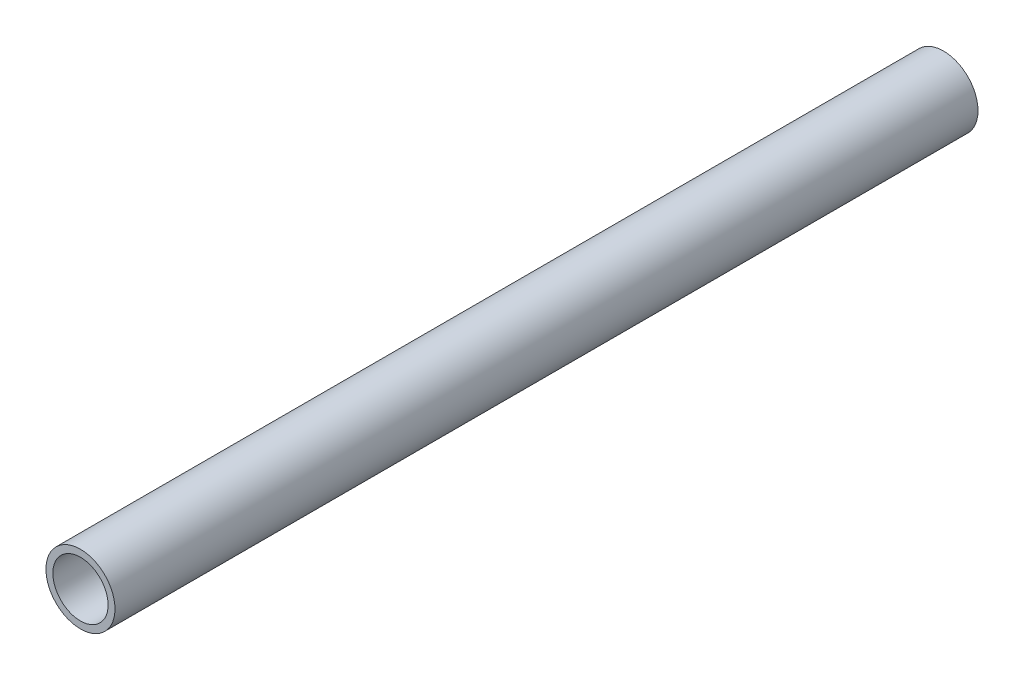
ISO-10303-21;
HEADER;
FILE_DESCRIPTION(('STEP AP214'),'2;1');
FILE_NAME('part.step','',(''),(''),'','','');
FILE_SCHEMA(('AUTOMOTIVE_DESIGN { 1 0 10303 214 1 1 1 1 }'));
ENDSEC;
DATA;
#1=APPLICATION_CONTEXT('core data for automotive mechanical design processes');
#2=APPLICATION_PROTOCOL_DEFINITION('international standard','automotive_design',2000,#1);
#3=PRODUCT_CONTEXT('',#1,'mechanical');
#4=PRODUCT('Part','Part','',(#3));
#5=PRODUCT_RELATED_PRODUCT_CATEGORY('part','',(#4));
#6=PRODUCT_DEFINITION_FORMATION('','',#4);
#7=PRODUCT_DEFINITION_CONTEXT('part definition',#1,'design');
#8=PRODUCT_DEFINITION('design','',#6,#7);
#9=PRODUCT_DEFINITION_SHAPE('','',#8);
#10=(LENGTH_UNIT() NAMED_UNIT(*) SI_UNIT(.MILLI.,.METRE.));
#11=(NAMED_UNIT(*) PLANE_ANGLE_UNIT() SI_UNIT($,.RADIAN.));
#12=(NAMED_UNIT(*) SI_UNIT($,.STERADIAN.) SOLID_ANGLE_UNIT());
#13=UNCERTAINTY_MEASURE_WITH_UNIT(LENGTH_MEASURE(1.E-05),#10,'distance_accuracy_value','');
#14=(GEOMETRIC_REPRESENTATION_CONTEXT(3) GLOBAL_UNCERTAINTY_ASSIGNED_CONTEXT((#13)) GLOBAL_UNIT_ASSIGNED_CONTEXT((#10,
#11,#12)) REPRESENTATION_CONTEXT('',''));
#15=CARTESIAN_POINT('',(0.,0.,0.));
#16=DIRECTION('',(0.,0.,1.));
#17=DIRECTION('',(1.,0.,0.));
#18=AXIS2_PLACEMENT_3D('',#15,#16,#17);
#19=CARTESIAN_POINT('',(0.,0.,317.5));
#20=DIRECTION('',(0.,0.,1.));
#21=DIRECTION('',(1.,0.,0.));
#22=AXIS2_PLACEMENT_3D('',#19,#20,#21);
#23=PLANE('',#22);
#24=CARTESIAN_POINT('',(0.,0.,317.5));
#25=DIRECTION('',(0.,0.,1.));
#26=DIRECTION('',(1.,0.,0.));
#27=AXIS2_PLACEMENT_3D('',#24,#25,#26);
#28=CIRCLE('',#27,12.7);
#29=CARTESIAN_POINT('',(12.7,0.,317.5));
#30=VERTEX_POINT('',#29);
#31=EDGE_CURVE('E10',#30,#30,#28,.T.);
#32=ORIENTED_EDGE('',*,*,#31,.T.);
#33=EDGE_LOOP('',(#32));
#34=FACE_BOUND('',#33,.T.);
#35=CARTESIAN_POINT('',(0.,0.,317.5));
#36=DIRECTION('',(0.,0.,1.));
#37=DIRECTION('',(1.,0.,0.));
#38=AXIS2_PLACEMENT_3D('',#35,#36,#37);
#39=CIRCLE('',#38,10.16);
#40=CARTESIAN_POINT('',(10.16,0.,317.5));
#41=VERTEX_POINT('',#40);
#42=EDGE_CURVE('E41',#41,#41,#39,.T.);
#43=ORIENTED_EDGE('',*,*,#42,.F.);
#44=EDGE_LOOP('',(#43));
#45=FACE_BOUND('',#44,.T.);
#46=ADVANCED_FACE('F30',(#34,#45),#23,.T.);
#47=CARTESIAN_POINT('',(0.,0.,0.));
#48=DIRECTION('',(0.,0.,1.));
#49=DIRECTION('',(1.,0.,0.));
#50=AXIS2_PLACEMENT_3D('',#47,#48,#49);
#51=PLANE('',#50);
#52=CARTESIAN_POINT('',(0.,0.,0.));
#53=DIRECTION('',(0.,0.,1.));
#54=DIRECTION('',(1.,0.,0.));
#55=AXIS2_PLACEMENT_3D('',#52,#53,#54);
#56=CIRCLE('',#55,12.7);
#57=CARTESIAN_POINT('',(12.7,0.,0.));
#58=VERTEX_POINT('',#57);
#59=EDGE_CURVE('E34',#58,#58,#56,.T.);
#60=ORIENTED_EDGE('',*,*,#59,.F.);
#61=EDGE_LOOP('',(#60));
#62=FACE_BOUND('',#61,.T.);
#63=CARTESIAN_POINT('',(0.,0.,0.));
#64=DIRECTION('',(0.,0.,1.));
#65=DIRECTION('',(1.,0.,0.));
#66=AXIS2_PLACEMENT_3D('',#63,#64,#65);
#67=CIRCLE('',#66,10.16);
#68=CARTESIAN_POINT('',(10.16,0.,0.));
#69=VERTEX_POINT('',#68);
#70=EDGE_CURVE('E43',#69,#69,#67,.T.);
#71=ORIENTED_EDGE('',*,*,#70,.T.);
#72=EDGE_LOOP('',(#71));
#73=FACE_BOUND('',#72,.T.);
#74=ADVANCED_FACE('F53',(#62,#73),#51,.F.);
#75=CARTESIAN_POINT('',(0.,0.,317.5));
#76=DIRECTION('',(0.,0.,-1.));
#77=DIRECTION('',(-1.,0.,0.));
#78=AXIS2_PLACEMENT_3D('',#75,#76,#77);
#79=CYLINDRICAL_SURFACE('',#78,12.7);
#80=ORIENTED_EDGE('',*,*,#31,.F.);
#81=EDGE_LOOP('',(#80));
#82=FACE_BOUND('',#81,.T.);
#83=ORIENTED_EDGE('',*,*,#59,.T.);
#84=EDGE_LOOP('',(#83));
#85=FACE_BOUND('',#84,.T.);
#86=ADVANCED_FACE('F32',(#82,#85),#79,.T.);
#87=CARTESIAN_POINT('',(0.,0.,317.5));
#88=DIRECTION('',(0.,0.,-1.));
#89=DIRECTION('',(-1.,0.,0.));
#90=AXIS2_PLACEMENT_3D('',#87,#88,#89);
#91=CYLINDRICAL_SURFACE('',#90,10.16);
#92=ORIENTED_EDGE('',*,*,#42,.T.);
#93=EDGE_LOOP('',(#92));
#94=FACE_BOUND('',#93,.T.);
#95=ORIENTED_EDGE('',*,*,#70,.F.);
#96=EDGE_LOOP('',(#95));
#97=FACE_BOUND('',#96,.T.);
#98=ADVANCED_FACE('F49',(#94,#97),#91,.F.);
#99=CLOSED_SHELL('',(#46,#74,#86,#98));
#100=MANIFOLD_SOLID_BREP('B2',#99);
#101=ADVANCED_BREP_SHAPE_REPRESENTATION('',(#18,#100),#14);
#102=SHAPE_DEFINITION_REPRESENTATION(#9,#101);
ENDSEC;
END-ISO-10303-21;
